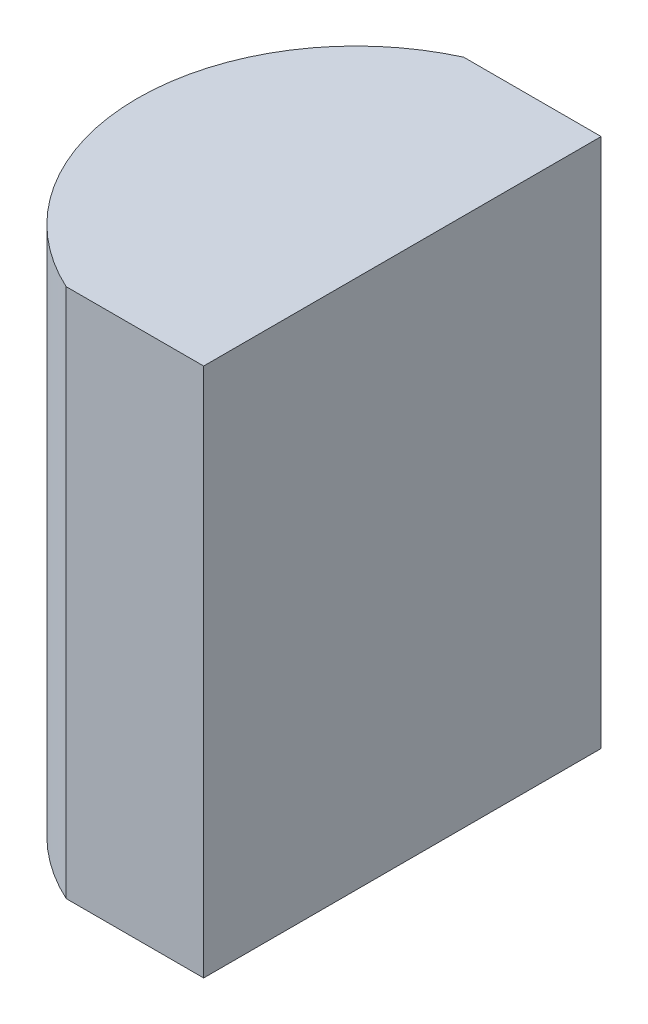
ISO-10303-21;
HEADER;
FILE_DESCRIPTION(('STEP AP214'),'2;1');
FILE_NAME('part.step','',(''),(''),'','','');
FILE_SCHEMA(('AUTOMOTIVE_DESIGN { 1 0 10303 214 1 1 1 1 }'));
ENDSEC;
DATA;
#1=APPLICATION_CONTEXT('core data for automotive mechanical design processes');
#2=APPLICATION_PROTOCOL_DEFINITION('international standard','automotive_design',2000,#1);
#3=PRODUCT_CONTEXT('',#1,'mechanical');
#4=PRODUCT('Part','Part','',(#3));
#5=PRODUCT_RELATED_PRODUCT_CATEGORY('part','',(#4));
#6=PRODUCT_DEFINITION_FORMATION('','',#4);
#7=PRODUCT_DEFINITION_CONTEXT('part definition',#1,'design');
#8=PRODUCT_DEFINITION('design','',#6,#7);
#9=PRODUCT_DEFINITION_SHAPE('','',#8);
#10=(LENGTH_UNIT() NAMED_UNIT(*) SI_UNIT(.MILLI.,.METRE.));
#11=(NAMED_UNIT(*) PLANE_ANGLE_UNIT() SI_UNIT($,.RADIAN.));
#12=(NAMED_UNIT(*) SI_UNIT($,.STERADIAN.) SOLID_ANGLE_UNIT());
#13=UNCERTAINTY_MEASURE_WITH_UNIT(LENGTH_MEASURE(1.E-05),#10,'distance_accuracy_value','');
#14=(GEOMETRIC_REPRESENTATION_CONTEXT(3) GLOBAL_UNCERTAINTY_ASSIGNED_CONTEXT((#13)) GLOBAL_UNIT_ASSIGNED_CONTEXT((#10,
#11,#12)) REPRESENTATION_CONTEXT('',''));
#15=CARTESIAN_POINT('',(0.,0.,0.));
#16=DIRECTION('',(0.,0.,1.));
#17=DIRECTION('',(1.,0.,0.));
#18=AXIS2_PLACEMENT_3D('',#15,#16,#17);
#19=CARTESIAN_POINT('',(4.35520433485127,8.,0.));
#20=DIRECTION('',(0.,-1.,0.));
#21=DIRECTION('',(0.,0.,-1.));
#22=AXIS2_PLACEMENT_3D('',#19,#20,#21);
#23=CYLINDRICAL_SURFACE('',#22,3.3);
#24=CARTESIAN_POINT('',(4.35520433485127,0.,0.));
#25=DIRECTION('',(0.,1.,0.));
#26=DIRECTION('',(0.,0.,1.));
#27=AXIS2_PLACEMENT_3D('',#24,#25,#26);
#28=CIRCLE('',#27,3.3);
#29=CARTESIAN_POINT('',(2.98043162636451,0.,-3.));
#30=VERTEX_POINT('',#29);
#31=CARTESIAN_POINT('',(2.98043162636451,0.,3.));
#32=VERTEX_POINT('',#31);
#33=EDGE_CURVE('E100',#30,#32,#28,.T.);
#34=ORIENTED_EDGE('',*,*,#33,.T.);
#35=DIRECTION('',(0.,-1.,0.));
#36=VECTOR('',#35,1.);
#37=CARTESIAN_POINT('',(2.98043162636451,8.,3.));
#38=LINE('',#37,#36);
#39=CARTESIAN_POINT('',(2.98043162636451,8.,3.));
#40=VERTEX_POINT('',#39);
#41=EDGE_CURVE('E11',#40,#32,#38,.T.);
#42=ORIENTED_EDGE('',*,*,#41,.F.);
#43=CARTESIAN_POINT('',(4.35520433485127,8.,0.));
#44=DIRECTION('',(0.,1.,0.));
#45=DIRECTION('',(0.,0.,1.));
#46=AXIS2_PLACEMENT_3D('',#43,#44,#45);
#47=CIRCLE('',#46,3.3);
#48=CARTESIAN_POINT('',(2.98043162636451,8.,-3.));
#49=VERTEX_POINT('',#48);
#50=EDGE_CURVE('E88',#49,#40,#47,.T.);
#51=ORIENTED_EDGE('',*,*,#50,.F.);
#52=DIRECTION('',(0.,-1.,0.));
#53=VECTOR('',#52,1.);
#54=CARTESIAN_POINT('',(2.98043162636451,8.,-3.));
#55=LINE('',#54,#53);
#56=EDGE_CURVE('E96',#49,#30,#55,.T.);
#57=ORIENTED_EDGE('',*,*,#56,.T.);
#58=EDGE_LOOP('',(#34,#42,#51,#57));
#59=FACE_BOUND('',#58,.T.);
#60=ADVANCED_FACE('F37',(#59),#23,.T.);
#61=CARTESIAN_POINT('',(2.98043162636451,8.,3.));
#62=DIRECTION('',(0.,0.,-1.));
#63=DIRECTION('',(-1.,0.,0.));
#64=AXIS2_PLACEMENT_3D('',#61,#62,#63);
#65=PLANE('',#64);
#66=DIRECTION('',(1.,0.,0.));
#67=VECTOR('',#66,1.);
#68=CARTESIAN_POINT('',(2.98043162636451,0.,3.));
#69=LINE('',#68,#67);
#70=CARTESIAN_POINT('',(5.05520433485127,0.,3.));
#71=VERTEX_POINT('',#70);
#72=EDGE_CURVE('E92',#32,#71,#69,.T.);
#73=ORIENTED_EDGE('',*,*,#72,.T.);
#74=DIRECTION('',(0.,-1.,0.));
#75=VECTOR('',#74,1.);
#76=CARTESIAN_POINT('',(5.05520433485127,8.,3.));
#77=LINE('',#76,#75);
#78=CARTESIAN_POINT('',(5.05520433485127,8.,3.));
#79=VERTEX_POINT('',#78);
#80=EDGE_CURVE('E45',#79,#71,#77,.T.);
#81=ORIENTED_EDGE('',*,*,#80,.F.);
#82=DIRECTION('',(1.,0.,0.));
#83=VECTOR('',#82,1.);
#84=CARTESIAN_POINT('',(2.98043162636451,8.,3.));
#85=LINE('',#84,#83);
#86=EDGE_CURVE('E83',#40,#79,#85,.T.);
#87=ORIENTED_EDGE('',*,*,#86,.F.);
#88=ORIENTED_EDGE('',*,*,#41,.T.);
#89=EDGE_LOOP('',(#73,#81,#87,#88));
#90=FACE_BOUND('',#89,.T.);
#91=ADVANCED_FACE('F91',(#90),#65,.F.);
#92=CARTESIAN_POINT('',(5.05520433485126,8.,-3.));
#93=DIRECTION('',(-1.,0.,0.));
#94=DIRECTION('',(0.,0.,1.));
#95=AXIS2_PLACEMENT_3D('',#92,#93,#94);
#96=PLANE('',#95);
#97=DIRECTION('',(0.,0.,-1.));
#98=VECTOR('',#97,1.);
#99=CARTESIAN_POINT('',(5.05520433485126,0.,-3.));
#100=LINE('',#99,#98);
#101=CARTESIAN_POINT('',(5.05520433485126,0.,-3.));
#102=VERTEX_POINT('',#101);
#103=EDGE_CURVE('E70',#71,#102,#100,.T.);
#104=ORIENTED_EDGE('',*,*,#103,.T.);
#105=DIRECTION('',(0.,-1.,0.));
#106=VECTOR('',#105,1.);
#107=CARTESIAN_POINT('',(5.05520433485126,8.,-3.));
#108=LINE('',#107,#106);
#109=CARTESIAN_POINT('',(5.05520433485126,8.,-3.));
#110=VERTEX_POINT('',#109);
#111=EDGE_CURVE('E93',#110,#102,#108,.T.);
#112=ORIENTED_EDGE('',*,*,#111,.F.);
#113=DIRECTION('',(0.,0.,-1.));
#114=VECTOR('',#113,1.);
#115=CARTESIAN_POINT('',(5.05520433485126,8.,-3.));
#116=LINE('',#115,#114);
#117=EDGE_CURVE('E86',#79,#110,#116,.T.);
#118=ORIENTED_EDGE('',*,*,#117,.F.);
#119=ORIENTED_EDGE('',*,*,#80,.T.);
#120=EDGE_LOOP('',(#104,#112,#118,#119));
#121=FACE_BOUND('',#120,.T.);
#122=ADVANCED_FACE('F94',(#121),#96,.F.);
#123=CARTESIAN_POINT('',(2.98043162636451,8.,-3.));
#124=DIRECTION('',(0.,0.,1.));
#125=DIRECTION('',(1.,0.,0.));
#126=AXIS2_PLACEMENT_3D('',#123,#124,#125);
#127=PLANE('',#126);
#128=DIRECTION('',(-1.,0.,0.));
#129=VECTOR('',#128,1.);
#130=CARTESIAN_POINT('',(2.98043162636451,0.,-3.));
#131=LINE('',#130,#129);
#132=EDGE_CURVE('E76',#102,#30,#131,.T.);
#133=ORIENTED_EDGE('',*,*,#132,.T.);
#134=ORIENTED_EDGE('',*,*,#56,.F.);
#135=DIRECTION('',(-1.,0.,0.));
#136=VECTOR('',#135,1.);
#137=CARTESIAN_POINT('',(2.98043162636451,8.,-3.));
#138=LINE('',#137,#136);
#139=EDGE_CURVE('E53',#110,#49,#138,.T.);
#140=ORIENTED_EDGE('',*,*,#139,.F.);
#141=ORIENTED_EDGE('',*,*,#111,.T.);
#142=EDGE_LOOP('',(#133,#134,#140,#141));
#143=FACE_BOUND('',#142,.T.);
#144=ADVANCED_FACE('F107',(#143),#127,.F.);
#145=CARTESIAN_POINT('',(4.35520433485127,8.,0.));
#146=DIRECTION('',(0.,1.,0.));
#147=DIRECTION('',(0.,0.,1.));
#148=AXIS2_PLACEMENT_3D('',#145,#146,#147);
#149=PLANE('',#148);
#150=ORIENTED_EDGE('',*,*,#50,.T.);
#151=ORIENTED_EDGE('',*,*,#86,.T.);
#152=ORIENTED_EDGE('',*,*,#117,.T.);
#153=ORIENTED_EDGE('',*,*,#139,.T.);
#154=EDGE_LOOP('',(#150,#151,#152,#153));
#155=FACE_BOUND('',#154,.T.);
#156=ADVANCED_FACE('F84',(#155),#149,.T.);
#157=CARTESIAN_POINT('',(4.35520433485127,0.,0.));
#158=DIRECTION('',(0.,1.,0.));
#159=DIRECTION('',(0.,0.,1.));
#160=AXIS2_PLACEMENT_3D('',#157,#158,#159);
#161=PLANE('',#160);
#162=ORIENTED_EDGE('',*,*,#33,.F.);
#163=ORIENTED_EDGE('',*,*,#132,.F.);
#164=ORIENTED_EDGE('',*,*,#103,.F.);
#165=ORIENTED_EDGE('',*,*,#72,.F.);
#166=EDGE_LOOP('',(#162,#163,#164,#165));
#167=FACE_BOUND('',#166,.T.);
#168=ADVANCED_FACE('F110',(#167),#161,.F.);
#169=CLOSED_SHELL('',(#60,#91,#122,#144,#156,#168));
#170=MANIFOLD_SOLID_BREP('B2',#169);
#171=ADVANCED_BREP_SHAPE_REPRESENTATION('',(#18,#170),#14);
#172=SHAPE_DEFINITION_REPRESENTATION(#9,#171);
ENDSEC;
END-ISO-10303-21;
